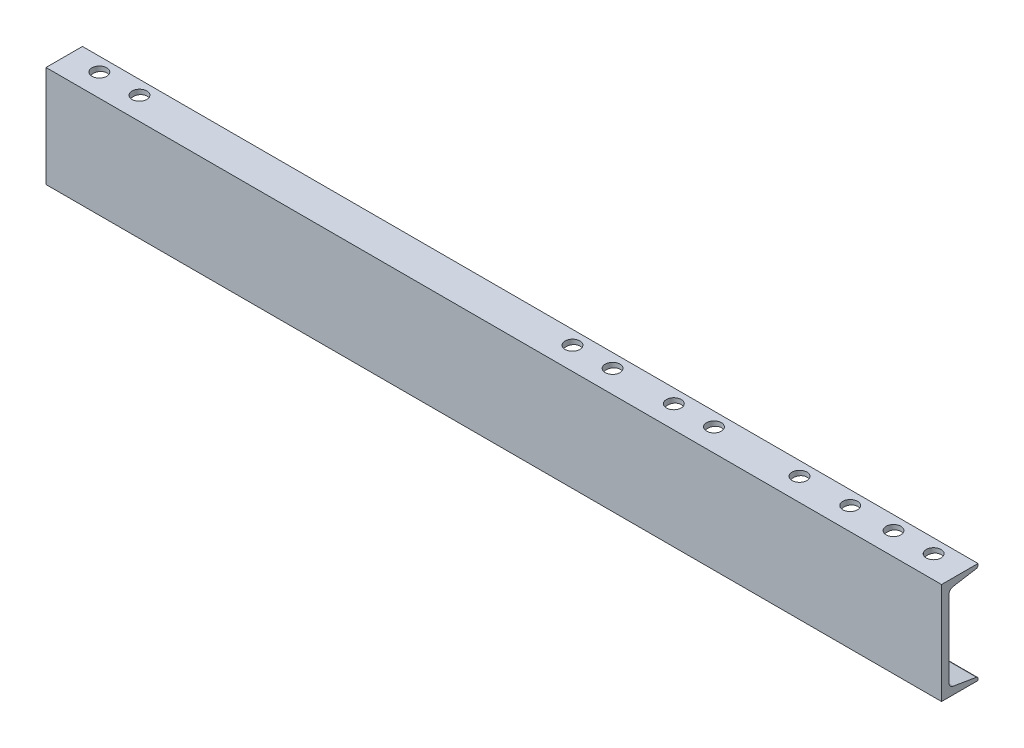
ISO-10303-21;
HEADER;
FILE_DESCRIPTION(('STEP AP214'),'2;1');
FILE_NAME('part.step','',(''),(''),'','','');
FILE_SCHEMA(('AUTOMOTIVE_DESIGN { 1 0 10303 214 1 1 1 1 }'));
ENDSEC;
DATA;
#1=APPLICATION_CONTEXT('core data for automotive mechanical design processes');
#2=APPLICATION_PROTOCOL_DEFINITION('international standard','automotive_design',2000,#1);
#3=PRODUCT_CONTEXT('',#1,'mechanical');
#4=PRODUCT('Part','Part','',(#3));
#5=PRODUCT_RELATED_PRODUCT_CATEGORY('part','',(#4));
#6=PRODUCT_DEFINITION_FORMATION('','',#4);
#7=PRODUCT_DEFINITION_CONTEXT('part definition',#1,'design');
#8=PRODUCT_DEFINITION('design','',#6,#7);
#9=PRODUCT_DEFINITION_SHAPE('','',#8);
#10=(LENGTH_UNIT() NAMED_UNIT(*) SI_UNIT(.MILLI.,.METRE.));
#11=(NAMED_UNIT(*) PLANE_ANGLE_UNIT() SI_UNIT($,.RADIAN.));
#12=(NAMED_UNIT(*) SI_UNIT($,.STERADIAN.) SOLID_ANGLE_UNIT());
#13=UNCERTAINTY_MEASURE_WITH_UNIT(LENGTH_MEASURE(1.E-05),#10,'distance_accuracy_value','');
#14=(GEOMETRIC_REPRESENTATION_CONTEXT(3) GLOBAL_UNCERTAINTY_ASSIGNED_CONTEXT((#13)) GLOBAL_UNIT_ASSIGNED_CONTEXT((#10,
#11,#12)) REPRESENTATION_CONTEXT('',''));
#15=CARTESIAN_POINT('',(0.,0.,0.));
#16=DIRECTION('',(0.,0.,1.));
#17=DIRECTION('',(1.,0.,0.));
#18=AXIS2_PLACEMENT_3D('',#15,#16,#17);
#19=CARTESIAN_POINT('',(673.1,-76.2,27.3939));
#20=DIRECTION('',(0.,1.,0.));
#21=DIRECTION('',(0.,0.,1.));
#22=AXIS2_PLACEMENT_3D('',#19,#20,#21);
#23=PLANE('',#22);
#24=CARTESIAN_POINT('',(501.65,-76.2,-6.73735));
#25=DIRECTION('',(0.,-1.,0.));
#26=DIRECTION('',(0.,0.,-1.));
#27=AXIS2_PLACEMENT_3D('',#24,#25,#26);
#28=CIRCLE('',#27,11.1125);
#29=CARTESIAN_POINT('',(501.65,-76.2,-17.84985));
#30=VERTEX_POINT('',#29);
#31=EDGE_CURVE('E250',#30,#30,#28,.T.);
#32=ORIENTED_EDGE('',*,*,#31,.F.);
#33=EDGE_LOOP('',(#32));
#34=FACE_BOUND('',#33,.T.);
#35=CARTESIAN_POINT('',(425.45,-76.2,-6.73735));
#36=DIRECTION('',(0.,-1.,0.));
#37=DIRECTION('',(0.,0.,-1.));
#38=AXIS2_PLACEMENT_3D('',#35,#36,#37);
#39=CIRCLE('',#38,11.1125);
#40=CARTESIAN_POINT('',(425.45,-76.2,-17.84985));
#41=VERTEX_POINT('',#40);
#42=EDGE_CURVE('E254',#41,#41,#39,.T.);
#43=ORIENTED_EDGE('',*,*,#42,.F.);
#44=EDGE_LOOP('',(#43));
#45=FACE_BOUND('',#44,.T.);
#46=CARTESIAN_POINT('',(-627.0625,-76.2,-6.73735));
#47=DIRECTION('',(0.,-1.,0.));
#48=DIRECTION('',(0.,0.,-1.));
#49=AXIS2_PLACEMENT_3D('',#46,#47,#48);
#50=CIRCLE('',#49,11.1125);
#51=CARTESIAN_POINT('',(-627.0625,-76.2,-17.84985));
#52=VERTEX_POINT('',#51);
#53=EDGE_CURVE('E258',#52,#52,#50,.T.);
#54=ORIENTED_EDGE('',*,*,#53,.F.);
#55=EDGE_LOOP('',(#54));
#56=FACE_BOUND('',#55,.T.);
#57=CARTESIAN_POINT('',(-566.7375,-76.2,-6.73735));
#58=DIRECTION('',(0.,-1.,0.));
#59=DIRECTION('',(0.,0.,-1.));
#60=AXIS2_PLACEMENT_3D('',#57,#58,#59);
#61=CIRCLE('',#60,11.1125);
#62=CARTESIAN_POINT('',(-566.7375,-76.2,-17.84985));
#63=VERTEX_POINT('',#62);
#64=EDGE_CURVE('E262',#63,#63,#61,.T.);
#65=ORIENTED_EDGE('',*,*,#64,.F.);
#66=EDGE_LOOP('',(#65));
#67=FACE_BOUND('',#66,.T.);
#68=CARTESIAN_POINT('',(84.1375,-76.2,-6.73735));
#69=DIRECTION('',(0.,-1.,0.));
#70=DIRECTION('',(0.,0.,-1.));
#71=AXIS2_PLACEMENT_3D('',#68,#69,#70);
#72=CIRCLE('',#71,11.1125);
#73=CARTESIAN_POINT('',(84.1375,-76.2,-17.84985));
#74=VERTEX_POINT('',#73);
#75=EDGE_CURVE('E266',#74,#74,#72,.T.);
#76=ORIENTED_EDGE('',*,*,#75,.F.);
#77=EDGE_LOOP('',(#76));
#78=FACE_BOUND('',#77,.T.);
#79=CARTESIAN_POINT('',(236.5375,-76.2,-6.73735));
#80=DIRECTION('',(0.,-1.,0.));
#81=DIRECTION('',(0.,0.,-1.));
#82=AXIS2_PLACEMENT_3D('',#79,#80,#81);
#83=CIRCLE('',#82,11.1125);
#84=CARTESIAN_POINT('',(236.5375,-76.2,-17.84985));
#85=VERTEX_POINT('',#84);
#86=EDGE_CURVE('E270',#85,#85,#83,.T.);
#87=ORIENTED_EDGE('',*,*,#86,.F.);
#88=EDGE_LOOP('',(#87));
#89=FACE_BOUND('',#88,.T.);
#90=CARTESIAN_POINT('',(296.8625,-76.2,-6.73735));
#91=DIRECTION('',(0.,-1.,0.));
#92=DIRECTION('',(0.,0.,-1.));
#93=AXIS2_PLACEMENT_3D('',#90,#91,#92);
#94=CIRCLE('',#93,11.1125);
#95=CARTESIAN_POINT('',(296.8625,-76.2,-17.84985));
#96=VERTEX_POINT('',#95);
#97=EDGE_CURVE('E274',#96,#96,#94,.T.);
#98=ORIENTED_EDGE('',*,*,#97,.F.);
#99=EDGE_LOOP('',(#98));
#100=FACE_BOUND('',#99,.T.);
#101=CARTESIAN_POINT('',(144.4625,-76.2,-6.73735));
#102=DIRECTION('',(0.,-1.,0.));
#103=DIRECTION('',(0.,0.,-1.));
#104=AXIS2_PLACEMENT_3D('',#101,#102,#103);
#105=CIRCLE('',#104,11.1125);
#106=CARTESIAN_POINT('',(144.4625,-76.2,-17.84985));
#107=VERTEX_POINT('',#106);
#108=EDGE_CURVE('E278',#107,#107,#105,.T.);
#109=ORIENTED_EDGE('',*,*,#108,.F.);
#110=EDGE_LOOP('',(#109));
#111=FACE_BOUND('',#110,.T.);
#112=CARTESIAN_POINT('',(566.7375,-76.2,-6.73735));
#113=DIRECTION('',(0.,-1.,0.));
#114=DIRECTION('',(0.,0.,-1.));
#115=AXIS2_PLACEMENT_3D('',#112,#113,#114);
#116=CIRCLE('',#115,11.1125);
#117=CARTESIAN_POINT('',(566.7375,-76.2,-17.84985));
#118=VERTEX_POINT('',#117);
#119=EDGE_CURVE('E282',#118,#118,#116,.T.);
#120=ORIENTED_EDGE('',*,*,#119,.F.);
#121=EDGE_LOOP('',(#120));
#122=FACE_BOUND('',#121,.T.);
#123=CARTESIAN_POINT('',(627.0625,-76.2,-6.73735));
#124=DIRECTION('',(0.,-1.,0.));
#125=DIRECTION('',(0.,0.,-1.));
#126=AXIS2_PLACEMENT_3D('',#123,#124,#125);
#127=CIRCLE('',#126,11.1125);
#128=CARTESIAN_POINT('',(627.0625,-76.2,-17.84985));
#129=VERTEX_POINT('',#128);
#130=EDGE_CURVE('E285',#129,#129,#127,.T.);
#131=ORIENTED_EDGE('',*,*,#130,.F.);
#132=EDGE_LOOP('',(#131));
#133=FACE_BOUND('',#132,.T.);
#134=DIRECTION('',(0.,0.,-1.));
#135=VECTOR('',#134,1.);
#136=CARTESIAN_POINT('',(-673.1,-76.2,27.3939));
#137=LINE('',#136,#135);
#138=CARTESIAN_POINT('',(-673.1,-76.2,27.3939));
#139=VERTEX_POINT('',#138);
#140=CARTESIAN_POINT('',(-673.1,-76.2,-27.3939));
#141=VERTEX_POINT('',#140);
#142=EDGE_CURVE('E137',#139,#141,#137,.T.);
#143=ORIENTED_EDGE('',*,*,#142,.T.);
#144=DIRECTION('',(-1.,0.,0.));
#145=VECTOR('',#144,1.);
#146=CARTESIAN_POINT('',(673.1,-76.2,-27.3939));
#147=LINE('',#146,#145);
#148=CARTESIAN_POINT('',(673.1,-76.2,-27.3939));
#149=VERTEX_POINT('',#148);
#150=EDGE_CURVE('E11',#149,#141,#147,.T.);
#151=ORIENTED_EDGE('',*,*,#150,.F.);
#152=DIRECTION('',(0.,0.,-1.));
#153=VECTOR('',#152,1.);
#154=CARTESIAN_POINT('',(673.1,-76.2,27.3939));
#155=LINE('',#154,#153);
#156=CARTESIAN_POINT('',(673.1,-76.2,27.3939));
#157=VERTEX_POINT('',#156);
#158=EDGE_CURVE('E160',#157,#149,#155,.T.);
#159=ORIENTED_EDGE('',*,*,#158,.F.);
#160=DIRECTION('',(-1.,0.,0.));
#161=VECTOR('',#160,1.);
#162=CARTESIAN_POINT('',(673.1,-76.2,27.3939));
#163=LINE('',#162,#161);
#164=EDGE_CURVE('E133',#157,#139,#163,.T.);
#165=ORIENTED_EDGE('',*,*,#164,.T.);
#166=EDGE_LOOP('',(#143,#151,#159,#165));
#167=FACE_BOUND('',#166,.T.);
#168=ADVANCED_FACE('F17',(#34,#45,#56,#67,#78,#89,#100,#111,#122,#133,#167),#23,.F.);
#169=CARTESIAN_POINT('',(673.1,-76.2,-27.3939));
#170=DIRECTION('',(0.,0.,1.));
#171=DIRECTION('',(1.,0.,0.));
#172=AXIS2_PLACEMENT_3D('',#169,#170,#171);
#173=PLANE('',#172);
#174=DIRECTION('',(0.,1.,0.));
#175=VECTOR('',#174,1.);
#176=CARTESIAN_POINT('',(-673.1,-76.2,-27.3939));
#177=LINE('',#176,#175);
#178=CARTESIAN_POINT('',(-673.1,-73.7107446530364,-27.3939));
#179=VERTEX_POINT('',#178);
#180=EDGE_CURVE('E140',#141,#179,#177,.T.);
#181=ORIENTED_EDGE('',*,*,#180,.T.);
#182=DIRECTION('',(-1.,0.,0.));
#183=VECTOR('',#182,1.);
#184=CARTESIAN_POINT('',(673.1,-73.7107446530364,-27.3939));
#185=LINE('',#184,#183);
#186=CARTESIAN_POINT('',(673.1,-73.7107446530364,-27.3939));
#187=VERTEX_POINT('',#186);
#188=EDGE_CURVE('E25',#187,#179,#185,.T.);
#189=ORIENTED_EDGE('',*,*,#188,.F.);
#190=DIRECTION('',(0.,1.,0.));
#191=VECTOR('',#190,1.);
#192=CARTESIAN_POINT('',(673.1,-76.2,-27.3939));
#193=LINE('',#192,#191);
#194=EDGE_CURVE('E88',#149,#187,#193,.T.);
#195=ORIENTED_EDGE('',*,*,#194,.F.);
#196=ORIENTED_EDGE('',*,*,#150,.T.);
#197=EDGE_LOOP('',(#181,#189,#195,#196));
#198=FACE_BOUND('',#197,.T.);
#199=ADVANCED_FACE('F241',(#198),#173,.F.);
#200=CARTESIAN_POINT('',(673.1,-73.7107446530364,-24.3459));
#201=DIRECTION('',(-1.,0.,0.));
#202=DIRECTION('',(0.,0.,1.));
#203=AXIS2_PLACEMENT_3D('',#200,#201,#202);
#204=CYLINDRICAL_SURFACE('',#203,3.048);
#205=CARTESIAN_POINT('',(-673.1,-73.7107446530364,-24.3459));
#206=DIRECTION('',(1.,0.,0.));
#207=DIRECTION('',(0.,0.,-1.));
#208=AXIS2_PLACEMENT_3D('',#205,#206,#207);
#209=CIRCLE('',#208,3.048);
#210=CARTESIAN_POINT('',(-673.1,-70.7042219011292,-24.8470236796088));
#211=VERTEX_POINT('',#210);
#212=EDGE_CURVE('E143',#179,#211,#209,.T.);
#213=ORIENTED_EDGE('',*,*,#212,.T.);
#214=DIRECTION('',(-1.,0.,0.));
#215=VECTOR('',#214,1.);
#216=CARTESIAN_POINT('',(673.1,-70.7042219011292,-24.8470236796088));
#217=LINE('',#216,#215);
#218=CARTESIAN_POINT('',(673.1,-70.7042219011292,-24.8470236796088));
#219=VERTEX_POINT('',#218);
#220=EDGE_CURVE('E179',#219,#211,#217,.T.);
#221=ORIENTED_EDGE('',*,*,#220,.F.);
#222=CARTESIAN_POINT('',(673.1,-73.7107446530364,-24.3459));
#223=DIRECTION('',(1.,0.,0.));
#224=DIRECTION('',(0.,0.,-1.));
#225=AXIS2_PLACEMENT_3D('',#222,#223,#224);
#226=CIRCLE('',#225,3.048);
#227=EDGE_CURVE('E187',#187,#219,#226,.T.);
#228=ORIENTED_EDGE('',*,*,#227,.F.);
#229=ORIENTED_EDGE('',*,*,#188,.T.);
#230=EDGE_LOOP('',(#213,#221,#228,#229));
#231=FACE_BOUND('',#230,.T.);
#232=ADVANCED_FACE('F185',(#231),#204,.T.);
#233=CARTESIAN_POINT('',(673.1,-64.908143628462,9.92690919902199));
#234=DIRECTION('',(0.,-0.986391978972162,0.164410656039631));
#235=DIRECTION('',(0.,-0.164410656039631,-0.986391978972162));
#236=AXIS2_PLACEMENT_3D('',#233,#234,#235);
#237=PLANE('',#236);
#238=CARTESIAN_POINT('',(501.65,-67.6857227711681,-6.73735));
#239=DIRECTION('',(0.,-0.986391978972162,0.164410656039631));
#240=DIRECTION('',(0.,-0.164410656039631,-0.986391978972162));
#241=AXIS2_PLACEMENT_3D('',#238,#239,#240);
#242=ELLIPSE('',#241,11.2658053156306,11.1125);
#243=CARTESIAN_POINT('',(501.65,-69.5379412139257,-17.8498499999999));
#244=VERTEX_POINT('',#243);
#245=EDGE_CURVE('E516',#244,#244,#242,.T.);
#246=ORIENTED_EDGE('',*,*,#245,.T.);
#247=EDGE_LOOP('',(#246));
#248=FACE_BOUND('',#247,.T.);
#249=CARTESIAN_POINT('',(425.45,-67.6857227711681,-6.73735));
#250=DIRECTION('',(0.,-0.986391978972162,0.164410656039631));
#251=DIRECTION('',(0.,-0.164410656039631,-0.986391978972162));
#252=AXIS2_PLACEMENT_3D('',#249,#250,#251);
#253=ELLIPSE('',#252,11.2658053156306,11.1125);
#254=CARTESIAN_POINT('',(425.45,-69.5379412139257,-17.84985));
#255=VERTEX_POINT('',#254);
#256=EDGE_CURVE('E532',#255,#255,#253,.T.);
#257=ORIENTED_EDGE('',*,*,#256,.T.);
#258=EDGE_LOOP('',(#257));
#259=FACE_BOUND('',#258,.T.);
#260=CARTESIAN_POINT('',(-627.0625,-67.6857227711681,-6.73735));
#261=DIRECTION('',(0.,-0.986391978972162,0.164410656039631));
#262=DIRECTION('',(0.,-0.164410656039631,-0.986391978972162));
#263=AXIS2_PLACEMENT_3D('',#260,#261,#262);
#264=ELLIPSE('',#263,11.2658053156306,11.1125);
#265=CARTESIAN_POINT('',(-627.0625,-69.5379412139257,-17.8498499999999));
#266=VERTEX_POINT('',#265);
#267=EDGE_CURVE('E542',#266,#266,#264,.T.);
#268=ORIENTED_EDGE('',*,*,#267,.T.);
#269=EDGE_LOOP('',(#268));
#270=FACE_BOUND('',#269,.T.);
#271=CARTESIAN_POINT('',(-566.7375,-67.6857227711681,-6.73735));
#272=DIRECTION('',(0.,-0.986391978972162,0.164410656039631));
#273=DIRECTION('',(0.,-0.164410656039631,-0.986391978972162));
#274=AXIS2_PLACEMENT_3D('',#271,#272,#273);
#275=ELLIPSE('',#274,11.2658053156306,11.1125);
#276=CARTESIAN_POINT('',(-566.7375,-69.5379412139257,-17.8498499999999));
#277=VERTEX_POINT('',#276);
#278=EDGE_CURVE('E552',#277,#277,#275,.T.);
#279=ORIENTED_EDGE('',*,*,#278,.T.);
#280=EDGE_LOOP('',(#279));
#281=FACE_BOUND('',#280,.T.);
#282=CARTESIAN_POINT('',(84.1375,-67.6857227711681,-6.73735));
#283=DIRECTION('',(0.,-0.986391978972162,0.164410656039631));
#284=DIRECTION('',(0.,-0.164410656039631,-0.986391978972162));
#285=AXIS2_PLACEMENT_3D('',#282,#283,#284);
#286=ELLIPSE('',#285,11.2658053156306,11.1125);
#287=CARTESIAN_POINT('',(84.1375,-69.5379412139257,-17.8498499999999));
#288=VERTEX_POINT('',#287);
#289=EDGE_CURVE('E562',#288,#288,#286,.T.);
#290=ORIENTED_EDGE('',*,*,#289,.T.);
#291=EDGE_LOOP('',(#290));
#292=FACE_BOUND('',#291,.T.);
#293=CARTESIAN_POINT('',(236.5375,-67.6857227711681,-6.73735));
#294=DIRECTION('',(0.,-0.986391978972162,0.164410656039631));
#295=DIRECTION('',(0.,-0.164410656039631,-0.986391978972162));
#296=AXIS2_PLACEMENT_3D('',#293,#294,#295);
#297=ELLIPSE('',#296,11.2658053156306,11.1125);
#298=CARTESIAN_POINT('',(236.5375,-69.5379412139257,-17.8498499999999));
#299=VERTEX_POINT('',#298);
#300=EDGE_CURVE('E572',#299,#299,#297,.T.);
#301=ORIENTED_EDGE('',*,*,#300,.T.);
#302=EDGE_LOOP('',(#301));
#303=FACE_BOUND('',#302,.T.);
#304=CARTESIAN_POINT('',(296.8625,-67.6857227711681,-6.73735));
#305=DIRECTION('',(0.,-0.986391978972162,0.164410656039631));
#306=DIRECTION('',(0.,-0.164410656039631,-0.986391978972162));
#307=AXIS2_PLACEMENT_3D('',#304,#305,#306);
#308=ELLIPSE('',#307,11.2658053156306,11.1125);
#309=CARTESIAN_POINT('',(296.8625,-69.5379412139257,-17.8498499999999));
#310=VERTEX_POINT('',#309);
#311=EDGE_CURVE('E582',#310,#310,#308,.T.);
#312=ORIENTED_EDGE('',*,*,#311,.T.);
#313=EDGE_LOOP('',(#312));
#314=FACE_BOUND('',#313,.T.);
#315=CARTESIAN_POINT('',(144.4625,-67.6857227711681,-6.73735));
#316=DIRECTION('',(0.,-0.986391978972162,0.164410656039631));
#317=DIRECTION('',(0.,-0.164410656039631,-0.986391978972162));
#318=AXIS2_PLACEMENT_3D('',#315,#316,#317);
#319=ELLIPSE('',#318,11.2658053156306,11.1125);
#320=CARTESIAN_POINT('',(144.4625,-69.5379412139257,-17.8498499999999));
#321=VERTEX_POINT('',#320);
#322=EDGE_CURVE('E592',#321,#321,#319,.T.);
#323=ORIENTED_EDGE('',*,*,#322,.T.);
#324=EDGE_LOOP('',(#323));
#325=FACE_BOUND('',#324,.T.);
#326=CARTESIAN_POINT('',(566.7375,-67.6857227711681,-6.73735));
#327=DIRECTION('',(0.,-0.986391978972162,0.164410656039631));
#328=DIRECTION('',(0.,-0.164410656039631,-0.986391978972162));
#329=AXIS2_PLACEMENT_3D('',#326,#327,#328);
#330=ELLIPSE('',#329,11.2658053156306,11.1125);
#331=CARTESIAN_POINT('',(566.7375,-69.5379412139257,-17.8498499999999));
#332=VERTEX_POINT('',#331);
#333=EDGE_CURVE('E288',#332,#332,#330,.T.);
#334=ORIENTED_EDGE('',*,*,#333,.T.);
#335=EDGE_LOOP('',(#334));
#336=FACE_BOUND('',#335,.T.);
#337=CARTESIAN_POINT('',(627.0625,-67.6857227711681,-6.73735));
#338=DIRECTION('',(0.,-0.986391978972162,0.164410656039631));
#339=DIRECTION('',(0.,-0.164410656039631,-0.986391978972162));
#340=AXIS2_PLACEMENT_3D('',#337,#338,#339);
#341=ELLIPSE('',#340,11.2658053156306,11.1125);
#342=CARTESIAN_POINT('',(627.0625,-69.5379412139257,-17.8498499999999));
#343=VERTEX_POINT('',#342);
#344=EDGE_CURVE('E141',#343,#343,#341,.T.);
#345=ORIENTED_EDGE('',*,*,#344,.T.);
#346=EDGE_LOOP('',(#345));
#347=FACE_BOUND('',#346,.T.);
#348=DIRECTION('',(0.,0.164410656039631,0.986391978972162));
#349=VECTOR('',#348,1.);
#350=CARTESIAN_POINT('',(-673.1,-64.908143628462,9.92690919902199));
#351=LINE('',#350,#349);
#352=CARTESIAN_POINT('',(-673.1,-64.908143628462,9.92690919902199));
#353=VERTEX_POINT('',#352);
#354=EDGE_CURVE('E145',#211,#353,#351,.T.);
#355=ORIENTED_EDGE('',*,*,#354,.T.);
#356=DIRECTION('',(-1.,0.,0.));
#357=VECTOR('',#356,1.);
#358=CARTESIAN_POINT('',(673.1,-64.908143628462,9.92690919902199));
#359=LINE('',#358,#357);
#360=CARTESIAN_POINT('',(673.1,-64.908143628462,9.92690919902199));
#361=VERTEX_POINT('',#360);
#362=EDGE_CURVE('E176',#361,#353,#359,.T.);
#363=ORIENTED_EDGE('',*,*,#362,.F.);
#364=DIRECTION('',(0.,0.164410656039631,0.986391978972162));
#365=VECTOR('',#364,1.);
#366=CARTESIAN_POINT('',(673.1,-64.908143628462,9.92690919902199));
#367=LINE('',#366,#365);
#368=EDGE_CURVE('E205',#219,#361,#367,.T.);
#369=ORIENTED_EDGE('',*,*,#368,.F.);
#370=ORIENTED_EDGE('',*,*,#220,.T.);
#371=EDGE_LOOP('',(#355,#363,#369,#370));
#372=FACE_BOUND('',#371,.T.);
#373=ADVANCED_FACE('F196',(#248,#259,#270,#281,#292,#303,#314,#325,#336,#347,#372),#237,.F.);
#374=CARTESIAN_POINT('',(673.1,-57.3918367486941,8.6741));
#375=DIRECTION('',(-1.,0.,0.));
#376=DIRECTION('',(0.,0.,1.));
#377=AXIS2_PLACEMENT_3D('',#374,#375,#376);
#378=CYLINDRICAL_SURFACE('',#377,7.62);
#379=CARTESIAN_POINT('',(-673.1,-57.3918367486941,8.6741));
#380=DIRECTION('',(-1.,0.,0.));
#381=DIRECTION('',(0.,0.,-1.));
#382=AXIS2_PLACEMENT_3D('',#379,#380,#381);
#383=CIRCLE('',#382,7.62);
#384=CARTESIAN_POINT('',(-673.1,-57.3918367486941,16.2941));
#385=VERTEX_POINT('',#384);
#386=EDGE_CURVE('E147',#353,#385,#383,.T.);
#387=ORIENTED_EDGE('',*,*,#386,.T.);
#388=DIRECTION('',(-1.,0.,0.));
#389=VECTOR('',#388,1.);
#390=CARTESIAN_POINT('',(673.1,-57.3918367486941,16.2941));
#391=LINE('',#390,#389);
#392=CARTESIAN_POINT('',(673.1,-57.3918367486941,16.2941));
#393=VERTEX_POINT('',#392);
#394=EDGE_CURVE('E173',#393,#385,#391,.T.);
#395=ORIENTED_EDGE('',*,*,#394,.F.);
#396=CARTESIAN_POINT('',(673.1,-57.3918367486941,8.6741));
#397=DIRECTION('',(-1.,0.,0.));
#398=DIRECTION('',(0.,0.,-1.));
#399=AXIS2_PLACEMENT_3D('',#396,#397,#398);
#400=CIRCLE('',#399,7.62);
#401=EDGE_CURVE('E202',#361,#393,#400,.T.);
#402=ORIENTED_EDGE('',*,*,#401,.F.);
#403=ORIENTED_EDGE('',*,*,#362,.T.);
#404=EDGE_LOOP('',(#387,#395,#402,#403));
#405=FACE_BOUND('',#404,.T.);
#406=ADVANCED_FACE('F200',(#405),#378,.F.);
#407=CARTESIAN_POINT('',(673.1,57.3918367486941,16.2941));
#408=DIRECTION('',(0.,0.,1.));
#409=DIRECTION('',(0.,-1.,0.));
#410=AXIS2_PLACEMENT_3D('',#407,#408,#409);
#411=PLANE('',#410);
#412=DIRECTION('',(0.,1.,0.));
#413=VECTOR('',#412,1.);
#414=CARTESIAN_POINT('',(-673.1,57.3918367486941,16.2941));
#415=LINE('',#414,#413);
#416=CARTESIAN_POINT('',(-673.1,57.3918367486941,16.2941));
#417=VERTEX_POINT('',#416);
#418=EDGE_CURVE('E149',#385,#417,#415,.T.);
#419=ORIENTED_EDGE('',*,*,#418,.T.);
#420=DIRECTION('',(-1.,0.,0.));
#421=VECTOR('',#420,1.);
#422=CARTESIAN_POINT('',(673.1,57.3918367486941,16.2941));
#423=LINE('',#422,#421);
#424=CARTESIAN_POINT('',(673.1,57.3918367486941,16.2941));
#425=VERTEX_POINT('',#424);
#426=EDGE_CURVE('E170',#425,#417,#423,.T.);
#427=ORIENTED_EDGE('',*,*,#426,.F.);
#428=DIRECTION('',(0.,1.,0.));
#429=VECTOR('',#428,1.);
#430=CARTESIAN_POINT('',(673.1,57.3918367486941,16.2941));
#431=LINE('',#430,#429);
#432=EDGE_CURVE('E204',#393,#425,#431,.T.);
#433=ORIENTED_EDGE('',*,*,#432,.F.);
#434=ORIENTED_EDGE('',*,*,#394,.T.);
#435=EDGE_LOOP('',(#419,#427,#433,#434));
#436=FACE_BOUND('',#435,.T.);
#437=ADVANCED_FACE('F615',(#436),#411,.F.);
#438=CARTESIAN_POINT('',(673.1,57.3918367486941,8.6741));
#439=DIRECTION('',(-1.,0.,0.));
#440=DIRECTION('',(0.,0.,1.));
#441=AXIS2_PLACEMENT_3D('',#438,#439,#440);
#442=CYLINDRICAL_SURFACE('',#441,7.62);
#443=CARTESIAN_POINT('',(-673.1,57.3918367486941,8.6741));
#444=DIRECTION('',(-1.,0.,0.));
#445=DIRECTION('',(0.,0.,1.));
#446=AXIS2_PLACEMENT_3D('',#443,#444,#445);
#447=CIRCLE('',#446,7.62);
#448=CARTESIAN_POINT('',(-673.1,64.908143628462,9.92690919902198));
#449=VERTEX_POINT('',#448);
#450=EDGE_CURVE('E151',#417,#449,#447,.T.);
#451=ORIENTED_EDGE('',*,*,#450,.T.);
#452=DIRECTION('',(-1.,0.,0.));
#453=VECTOR('',#452,1.);
#454=CARTESIAN_POINT('',(673.1,64.908143628462,9.92690919902198));
#455=LINE('',#454,#453);
#456=CARTESIAN_POINT('',(673.1,64.908143628462,9.92690919902198));
#457=VERTEX_POINT('',#456);
#458=EDGE_CURVE('E167',#457,#449,#455,.T.);
#459=ORIENTED_EDGE('',*,*,#458,.F.);
#460=CARTESIAN_POINT('',(673.1,57.3918367486941,8.6741));
#461=DIRECTION('',(-1.,0.,0.));
#462=DIRECTION('',(0.,0.,1.));
#463=AXIS2_PLACEMENT_3D('',#460,#461,#462);
#464=CIRCLE('',#463,7.62);
#465=EDGE_CURVE('E207',#425,#457,#464,.T.);
#466=ORIENTED_EDGE('',*,*,#465,.F.);
#467=ORIENTED_EDGE('',*,*,#426,.T.);
#468=EDGE_LOOP('',(#451,#459,#466,#467));
#469=FACE_BOUND('',#468,.T.);
#470=ADVANCED_FACE('F604',(#469),#442,.F.);
#471=CARTESIAN_POINT('',(673.1,64.908143628462,9.92690919902198));
#472=DIRECTION('',(0.,0.986391978972162,0.16441065603963));
#473=DIRECTION('',(0.,-0.16441065603963,0.986391978972162));
#474=AXIS2_PLACEMENT_3D('',#471,#472,#473);
#475=PLANE('',#474);
#476=CARTESIAN_POINT('',(501.65,67.6857227711681,-6.73735));
#477=DIRECTION('',(0.,0.986391978972162,0.16441065603963));
#478=DIRECTION('',(0.,-0.16441065603963,0.986391978972162));
#479=AXIS2_PLACEMENT_3D('',#476,#477,#478);
#480=ELLIPSE('',#479,11.2658053156306,11.1125);
#481=CARTESIAN_POINT('',(501.65,65.8335043284105,4.37514999999995));
#482=VERTEX_POINT('',#481);
#483=EDGE_CURVE('E518',#482,#482,#480,.T.);
#484=ORIENTED_EDGE('',*,*,#483,.T.);
#485=EDGE_LOOP('',(#484));
#486=FACE_BOUND('',#485,.T.);
#487=CARTESIAN_POINT('',(425.45,67.6857227711681,-6.73735));
#488=DIRECTION('',(0.,0.986391978972162,0.16441065603963));
#489=DIRECTION('',(0.,-0.16441065603963,0.986391978972162));
#490=AXIS2_PLACEMENT_3D('',#487,#488,#489);
#491=ELLIPSE('',#490,11.2658053156306,11.1125);
#492=CARTESIAN_POINT('',(425.45,65.8335043284105,4.37515000000001));
#493=VERTEX_POINT('',#492);
#494=EDGE_CURVE('E529',#493,#493,#491,.T.);
#495=ORIENTED_EDGE('',*,*,#494,.T.);
#496=EDGE_LOOP('',(#495));
#497=FACE_BOUND('',#496,.T.);
#498=CARTESIAN_POINT('',(-627.0625,67.6857227711681,-6.73735));
#499=DIRECTION('',(0.,0.986391978972162,0.16441065603963));
#500=DIRECTION('',(0.,-0.16441065603963,0.986391978972162));
#501=AXIS2_PLACEMENT_3D('',#498,#499,#500);
#502=ELLIPSE('',#501,11.2658053156306,11.1125);
#503=CARTESIAN_POINT('',(-627.0625,65.8335043284105,4.37514999999995));
#504=VERTEX_POINT('',#503);
#505=EDGE_CURVE('E539',#504,#504,#502,.T.);
#506=ORIENTED_EDGE('',*,*,#505,.T.);
#507=EDGE_LOOP('',(#506));
#508=FACE_BOUND('',#507,.T.);
#509=CARTESIAN_POINT('',(-566.7375,67.6857227711681,-6.73735));
#510=DIRECTION('',(0.,0.986391978972162,0.16441065603963));
#511=DIRECTION('',(0.,-0.16441065603963,0.986391978972162));
#512=AXIS2_PLACEMENT_3D('',#509,#510,#511);
#513=ELLIPSE('',#512,11.2658053156306,11.1125);
#514=CARTESIAN_POINT('',(-566.7375,65.8335043284105,4.37514999999995));
#515=VERTEX_POINT('',#514);
#516=EDGE_CURVE('E549',#515,#515,#513,.T.);
#517=ORIENTED_EDGE('',*,*,#516,.T.);
#518=EDGE_LOOP('',(#517));
#519=FACE_BOUND('',#518,.T.);
#520=CARTESIAN_POINT('',(84.1375,67.6857227711681,-6.73735));
#521=DIRECTION('',(0.,0.986391978972162,0.16441065603963));
#522=DIRECTION('',(0.,-0.16441065603963,0.986391978972162));
#523=AXIS2_PLACEMENT_3D('',#520,#521,#522);
#524=ELLIPSE('',#523,11.2658053156306,11.1125);
#525=CARTESIAN_POINT('',(84.1375,65.8335043284105,4.37514999999995));
#526=VERTEX_POINT('',#525);
#527=EDGE_CURVE('E559',#526,#526,#524,.T.);
#528=ORIENTED_EDGE('',*,*,#527,.T.);
#529=EDGE_LOOP('',(#528));
#530=FACE_BOUND('',#529,.T.);
#531=CARTESIAN_POINT('',(236.5375,67.6857227711681,-6.73735));
#532=DIRECTION('',(0.,0.986391978972162,0.16441065603963));
#533=DIRECTION('',(0.,-0.16441065603963,0.986391978972162));
#534=AXIS2_PLACEMENT_3D('',#531,#532,#533);
#535=ELLIPSE('',#534,11.2658053156306,11.1125);
#536=CARTESIAN_POINT('',(236.5375,65.8335043284105,4.37514999999995));
#537=VERTEX_POINT('',#536);
#538=EDGE_CURVE('E569',#537,#537,#535,.T.);
#539=ORIENTED_EDGE('',*,*,#538,.T.);
#540=EDGE_LOOP('',(#539));
#541=FACE_BOUND('',#540,.T.);
#542=CARTESIAN_POINT('',(296.8625,67.6857227711681,-6.73735));
#543=DIRECTION('',(0.,0.986391978972162,0.16441065603963));
#544=DIRECTION('',(0.,-0.16441065603963,0.986391978972162));
#545=AXIS2_PLACEMENT_3D('',#542,#543,#544);
#546=ELLIPSE('',#545,11.2658053156306,11.1125);
#547=CARTESIAN_POINT('',(296.8625,65.8335043284105,4.37514999999995));
#548=VERTEX_POINT('',#547);
#549=EDGE_CURVE('E579',#548,#548,#546,.T.);
#550=ORIENTED_EDGE('',*,*,#549,.T.);
#551=EDGE_LOOP('',(#550));
#552=FACE_BOUND('',#551,.T.);
#553=CARTESIAN_POINT('',(144.4625,67.6857227711681,-6.73735));
#554=DIRECTION('',(0.,0.986391978972162,0.16441065603963));
#555=DIRECTION('',(0.,-0.16441065603963,0.986391978972162));
#556=AXIS2_PLACEMENT_3D('',#553,#554,#555);
#557=ELLIPSE('',#556,11.2658053156306,11.1125);
#558=CARTESIAN_POINT('',(144.4625,65.8335043284105,4.37514999999995));
#559=VERTEX_POINT('',#558);
#560=EDGE_CURVE('E589',#559,#559,#557,.T.);
#561=ORIENTED_EDGE('',*,*,#560,.T.);
#562=EDGE_LOOP('',(#561));
#563=FACE_BOUND('',#562,.T.);
#564=CARTESIAN_POINT('',(566.7375,67.6857227711681,-6.73735));
#565=DIRECTION('',(0.,0.986391978972162,0.16441065603963));
#566=DIRECTION('',(0.,-0.16441065603963,0.986391978972162));
#567=AXIS2_PLACEMENT_3D('',#564,#565,#566);
#568=ELLIPSE('',#567,11.2658053156306,11.1125);
#569=CARTESIAN_POINT('',(566.7375,65.8335043284105,4.37514999999995));
#570=VERTEX_POINT('',#569);
#571=EDGE_CURVE('E294',#570,#570,#568,.T.);
#572=ORIENTED_EDGE('',*,*,#571,.T.);
#573=EDGE_LOOP('',(#572));
#574=FACE_BOUND('',#573,.T.);
#575=CARTESIAN_POINT('',(627.0625,67.6857227711681,-6.73735));
#576=DIRECTION('',(0.,0.986391978972162,0.16441065603963));
#577=DIRECTION('',(0.,-0.16441065603963,0.986391978972162));
#578=AXIS2_PLACEMENT_3D('',#575,#576,#577);
#579=ELLIPSE('',#578,11.2658053156306,11.1125);
#580=CARTESIAN_POINT('',(627.0625,65.8335043284105,4.37514999999995));
#581=VERTEX_POINT('',#580);
#582=EDGE_CURVE('E291',#581,#581,#579,.T.);
#583=ORIENTED_EDGE('',*,*,#582,.T.);
#584=EDGE_LOOP('',(#583));
#585=FACE_BOUND('',#584,.T.);
#586=DIRECTION('',(0.,0.16441065603963,-0.986391978972162));
#587=VECTOR('',#586,1.);
#588=CARTESIAN_POINT('',(-673.1,64.908143628462,9.92690919902198));
#589=LINE('',#588,#587);
#590=CARTESIAN_POINT('',(-673.1,70.7042219011292,-24.8470236796088));
#591=VERTEX_POINT('',#590);
#592=EDGE_CURVE('E153',#449,#591,#589,.T.);
#593=ORIENTED_EDGE('',*,*,#592,.T.);
#594=DIRECTION('',(-1.,0.,0.));
#595=VECTOR('',#594,1.);
#596=CARTESIAN_POINT('',(673.1,70.7042219011292,-24.8470236796088));
#597=LINE('',#596,#595);
#598=CARTESIAN_POINT('',(673.1,70.7042219011292,-24.8470236796088));
#599=VERTEX_POINT('',#598);
#600=EDGE_CURVE('E164',#599,#591,#597,.T.);
#601=ORIENTED_EDGE('',*,*,#600,.F.);
#602=DIRECTION('',(0.,0.16441065603963,-0.986391978972162));
#603=VECTOR('',#602,1.);
#604=CARTESIAN_POINT('',(673.1,64.908143628462,9.92690919902198));
#605=LINE('',#604,#603);
#606=EDGE_CURVE('E213',#457,#599,#605,.T.);
#607=ORIENTED_EDGE('',*,*,#606,.F.);
#608=ORIENTED_EDGE('',*,*,#458,.T.);
#609=EDGE_LOOP('',(#593,#601,#607,#608));
#610=FACE_BOUND('',#609,.T.);
#611=ADVANCED_FACE('F219',(#486,#497,#508,#519,#530,#541,#552,#563,#574,#585,#610),#475,.F.);
#612=CARTESIAN_POINT('',(673.1,73.7107446530364,-24.3459));
#613=DIRECTION('',(-1.,0.,0.));
#614=DIRECTION('',(0.,0.,1.));
#615=AXIS2_PLACEMENT_3D('',#612,#613,#614);
#616=CYLINDRICAL_SURFACE('',#615,3.048);
#617=CARTESIAN_POINT('',(-673.1,73.7107446530364,-24.3459));
#618=DIRECTION('',(1.,0.,0.));
#619=DIRECTION('',(0.,0.,1.));
#620=AXIS2_PLACEMENT_3D('',#617,#618,#619);
#621=CIRCLE('',#620,3.048);
#622=CARTESIAN_POINT('',(-673.1,73.7107446530364,-27.3939));
#623=VERTEX_POINT('',#622);
#624=EDGE_CURVE('E155',#591,#623,#621,.T.);
#625=ORIENTED_EDGE('',*,*,#624,.T.);
#626=DIRECTION('',(-1.,0.,0.));
#627=VECTOR('',#626,1.);
#628=CARTESIAN_POINT('',(673.1,73.7107446530364,-27.3939));
#629=LINE('',#628,#627);
#630=CARTESIAN_POINT('',(673.1,73.7107446530364,-27.3939));
#631=VERTEX_POINT('',#630);
#632=EDGE_CURVE('E128',#631,#623,#629,.T.);
#633=ORIENTED_EDGE('',*,*,#632,.F.);
#634=CARTESIAN_POINT('',(673.1,73.7107446530364,-24.3459));
#635=DIRECTION('',(1.,0.,0.));
#636=DIRECTION('',(0.,0.,1.));
#637=AXIS2_PLACEMENT_3D('',#634,#635,#636);
#638=CIRCLE('',#637,3.048);
#639=EDGE_CURVE('E119',#599,#631,#638,.T.);
#640=ORIENTED_EDGE('',*,*,#639,.F.);
#641=ORIENTED_EDGE('',*,*,#600,.T.);
#642=EDGE_LOOP('',(#625,#633,#640,#641));
#643=FACE_BOUND('',#642,.T.);
#644=ADVANCED_FACE('F223',(#643),#616,.T.);
#645=CARTESIAN_POINT('',(673.1,76.2,-27.3939));
#646=DIRECTION('',(0.,0.,1.));
#647=DIRECTION('',(0.,-1.,0.));
#648=AXIS2_PLACEMENT_3D('',#645,#646,#647);
#649=PLANE('',#648);
#650=DIRECTION('',(0.,1.,0.));
#651=VECTOR('',#650,1.);
#652=CARTESIAN_POINT('',(-673.1,76.2,-27.3939));
#653=LINE('',#652,#651);
#654=CARTESIAN_POINT('',(-673.1,76.2,-27.3939));
#655=VERTEX_POINT('',#654);
#656=EDGE_CURVE('E127',#623,#655,#653,.T.);
#657=ORIENTED_EDGE('',*,*,#656,.T.);
#658=DIRECTION('',(-1.,0.,0.));
#659=VECTOR('',#658,1.);
#660=CARTESIAN_POINT('',(673.1,76.2,-27.3939));
#661=LINE('',#660,#659);
#662=CARTESIAN_POINT('',(673.1,76.2,-27.3939));
#663=VERTEX_POINT('',#662);
#664=EDGE_CURVE('E124',#663,#655,#661,.T.);
#665=ORIENTED_EDGE('',*,*,#664,.F.);
#666=DIRECTION('',(0.,1.,0.));
#667=VECTOR('',#666,1.);
#668=CARTESIAN_POINT('',(673.1,76.2,-27.3939));
#669=LINE('',#668,#667);
#670=EDGE_CURVE('E113',#631,#663,#669,.T.);
#671=ORIENTED_EDGE('',*,*,#670,.F.);
#672=ORIENTED_EDGE('',*,*,#632,.T.);
#673=EDGE_LOOP('',(#657,#665,#671,#672));
#674=FACE_BOUND('',#673,.T.);
#675=ADVANCED_FACE('F125',(#674),#649,.F.);
#676=CARTESIAN_POINT('',(673.1,76.2,27.3939));
#677=DIRECTION('',(0.,-1.,0.));
#678=DIRECTION('',(0.,0.,-1.));
#679=AXIS2_PLACEMENT_3D('',#676,#677,#678);
#680=PLANE('',#679);
#681=CARTESIAN_POINT('',(501.65,76.2,-6.73735));
#682=DIRECTION('',(0.,-1.,0.));
#683=DIRECTION('',(0.,0.,-1.));
#684=AXIS2_PLACEMENT_3D('',#681,#682,#683);
#685=CIRCLE('',#684,11.1125);
#686=CARTESIAN_POINT('',(501.65,76.2,-17.84985));
#687=VERTEX_POINT('',#686);
#688=EDGE_CURVE('E523',#687,#687,#685,.F.);
#689=ORIENTED_EDGE('',*,*,#688,.F.);
#690=EDGE_LOOP('',(#689));
#691=FACE_BOUND('',#690,.T.);
#692=CARTESIAN_POINT('',(425.45,76.2,-6.73735));
#693=DIRECTION('',(0.,-1.,0.));
#694=DIRECTION('',(0.,0.,-1.));
#695=AXIS2_PLACEMENT_3D('',#692,#693,#694);
#696=CIRCLE('',#695,11.1125);
#697=CARTESIAN_POINT('',(425.45,76.2,-17.84985));
#698=VERTEX_POINT('',#697);
#699=EDGE_CURVE('E520',#698,#698,#696,.F.);
#700=ORIENTED_EDGE('',*,*,#699,.F.);
#701=EDGE_LOOP('',(#700));
#702=FACE_BOUND('',#701,.T.);
#703=CARTESIAN_POINT('',(-627.0625,76.2,-6.73735));
#704=DIRECTION('',(0.,-1.,0.));
#705=DIRECTION('',(0.,0.,-1.));
#706=AXIS2_PLACEMENT_3D('',#703,#704,#705);
#707=CIRCLE('',#706,11.1125);
#708=CARTESIAN_POINT('',(-627.0625,76.2,-17.84985));
#709=VERTEX_POINT('',#708);
#710=EDGE_CURVE('E536',#709,#709,#707,.F.);
#711=ORIENTED_EDGE('',*,*,#710,.F.);
#712=EDGE_LOOP('',(#711));
#713=FACE_BOUND('',#712,.T.);
#714=CARTESIAN_POINT('',(-566.7375,76.2,-6.73735));
#715=DIRECTION('',(0.,-1.,0.));
#716=DIRECTION('',(0.,0.,-1.));
#717=AXIS2_PLACEMENT_3D('',#714,#715,#716);
#718=CIRCLE('',#717,11.1125);
#719=CARTESIAN_POINT('',(-566.7375,76.2,-17.84985));
#720=VERTEX_POINT('',#719);
#721=EDGE_CURVE('E546',#720,#720,#718,.F.);
#722=ORIENTED_EDGE('',*,*,#721,.F.);
#723=EDGE_LOOP('',(#722));
#724=FACE_BOUND('',#723,.T.);
#725=CARTESIAN_POINT('',(84.1375,76.2,-6.73735));
#726=DIRECTION('',(0.,-1.,0.));
#727=DIRECTION('',(0.,0.,-1.));
#728=AXIS2_PLACEMENT_3D('',#725,#726,#727);
#729=CIRCLE('',#728,11.1125);
#730=CARTESIAN_POINT('',(84.1375,76.2,-17.84985));
#731=VERTEX_POINT('',#730);
#732=EDGE_CURVE('E556',#731,#731,#729,.F.);
#733=ORIENTED_EDGE('',*,*,#732,.F.);
#734=EDGE_LOOP('',(#733));
#735=FACE_BOUND('',#734,.T.);
#736=CARTESIAN_POINT('',(236.5375,76.2,-6.73735));
#737=DIRECTION('',(0.,-1.,0.));
#738=DIRECTION('',(0.,0.,-1.));
#739=AXIS2_PLACEMENT_3D('',#736,#737,#738);
#740=CIRCLE('',#739,11.1125);
#741=CARTESIAN_POINT('',(236.5375,76.2,-17.84985));
#742=VERTEX_POINT('',#741);
#743=EDGE_CURVE('E566',#742,#742,#740,.F.);
#744=ORIENTED_EDGE('',*,*,#743,.F.);
#745=EDGE_LOOP('',(#744));
#746=FACE_BOUND('',#745,.T.);
#747=CARTESIAN_POINT('',(296.8625,76.2,-6.73735));
#748=DIRECTION('',(0.,-1.,0.));
#749=DIRECTION('',(0.,0.,-1.));
#750=AXIS2_PLACEMENT_3D('',#747,#748,#749);
#751=CIRCLE('',#750,11.1125);
#752=CARTESIAN_POINT('',(296.8625,76.2,-17.84985));
#753=VERTEX_POINT('',#752);
#754=EDGE_CURVE('E576',#753,#753,#751,.F.);
#755=ORIENTED_EDGE('',*,*,#754,.F.);
#756=EDGE_LOOP('',(#755));
#757=FACE_BOUND('',#756,.T.);
#758=CARTESIAN_POINT('',(144.4625,76.2,-6.73735));
#759=DIRECTION('',(0.,-1.,0.));
#760=DIRECTION('',(0.,0.,-1.));
#761=AXIS2_PLACEMENT_3D('',#758,#759,#760);
#762=CIRCLE('',#761,11.1125);
#763=CARTESIAN_POINT('',(144.4625,76.2,-17.84985));
#764=VERTEX_POINT('',#763);
#765=EDGE_CURVE('E586',#764,#764,#762,.F.);
#766=ORIENTED_EDGE('',*,*,#765,.F.);
#767=EDGE_LOOP('',(#766));
#768=FACE_BOUND('',#767,.T.);
#769=CARTESIAN_POINT('',(566.7375,76.2,-6.73735));
#770=DIRECTION('',(0.,-1.,0.));
#771=DIRECTION('',(0.,0.,-1.));
#772=AXIS2_PLACEMENT_3D('',#769,#770,#771);
#773=CIRCLE('',#772,11.1125);
#774=CARTESIAN_POINT('',(566.7375,76.2,-17.84985));
#775=VERTEX_POINT('',#774);
#776=EDGE_CURVE('E596',#775,#775,#773,.F.);
#777=ORIENTED_EDGE('',*,*,#776,.F.);
#778=EDGE_LOOP('',(#777));
#779=FACE_BOUND('',#778,.T.);
#780=CARTESIAN_POINT('',(627.0625,76.2,-6.73735));
#781=DIRECTION('',(0.,-1.,0.));
#782=DIRECTION('',(0.,0.,-1.));
#783=AXIS2_PLACEMENT_3D('',#780,#781,#782);
#784=CIRCLE('',#783,11.1125);
#785=CARTESIAN_POINT('',(627.0625,76.2,-17.84985));
#786=VERTEX_POINT('',#785);
#787=EDGE_CURVE('E287',#786,#786,#784,.F.);
#788=ORIENTED_EDGE('',*,*,#787,.F.);
#789=EDGE_LOOP('',(#788));
#790=FACE_BOUND('',#789,.T.);
#791=DIRECTION('',(0.,0.,1.));
#792=VECTOR('',#791,1.);
#793=CARTESIAN_POINT('',(-673.1,76.2,27.3939));
#794=LINE('',#793,#792);
#795=CARTESIAN_POINT('',(-673.1,76.2,27.3939));
#796=VERTEX_POINT('',#795);
#797=EDGE_CURVE('E74',#655,#796,#794,.T.);
#798=ORIENTED_EDGE('',*,*,#797,.T.);
#799=DIRECTION('',(-1.,0.,0.));
#800=VECTOR('',#799,1.);
#801=CARTESIAN_POINT('',(673.1,76.2,27.3939));
#802=LINE('',#801,#800);
#803=CARTESIAN_POINT('',(673.1,76.2,27.3939));
#804=VERTEX_POINT('',#803);
#805=EDGE_CURVE('E129',#804,#796,#802,.T.);
#806=ORIENTED_EDGE('',*,*,#805,.F.);
#807=DIRECTION('',(0.,0.,1.));
#808=VECTOR('',#807,1.);
#809=CARTESIAN_POINT('',(673.1,76.2,27.3939));
#810=LINE('',#809,#808);
#811=EDGE_CURVE('E117',#663,#804,#810,.T.);
#812=ORIENTED_EDGE('',*,*,#811,.F.);
#813=ORIENTED_EDGE('',*,*,#664,.T.);
#814=EDGE_LOOP('',(#798,#806,#812,#813));
#815=FACE_BOUND('',#814,.T.);
#816=ADVANCED_FACE('F131',(#691,#702,#713,#724,#735,#746,#757,#768,#779,#790,#815),#680,.F.);
#817=CARTESIAN_POINT('',(673.1,-76.2,27.3939));
#818=DIRECTION('',(0.,0.,-1.));
#819=DIRECTION('',(-1.,0.,0.));
#820=AXIS2_PLACEMENT_3D('',#817,#818,#819);
#821=PLANE('',#820);
#822=DIRECTION('',(0.,-1.,0.));
#823=VECTOR('',#822,1.);
#824=CARTESIAN_POINT('',(-673.1,-76.2,27.3939));
#825=LINE('',#824,#823);
#826=EDGE_CURVE('E80',#796,#139,#825,.T.);
#827=ORIENTED_EDGE('',*,*,#826,.T.);
#828=ORIENTED_EDGE('',*,*,#164,.F.);
#829=DIRECTION('',(0.,-1.,0.));
#830=VECTOR('',#829,1.);
#831=CARTESIAN_POINT('',(673.1,-76.2,27.3939));
#832=LINE('',#831,#830);
#833=EDGE_CURVE('E33',#804,#157,#832,.T.);
#834=ORIENTED_EDGE('',*,*,#833,.F.);
#835=ORIENTED_EDGE('',*,*,#805,.T.);
#836=EDGE_LOOP('',(#827,#828,#834,#835));
#837=FACE_BOUND('',#836,.T.);
#838=ADVANCED_FACE('F227',(#837),#821,.F.);
#839=CARTESIAN_POINT('',(673.1,-73.7107446530364,-24.3459));
#840=DIRECTION('',(1.,0.,0.));
#841=DIRECTION('',(0.,0.,-1.));
#842=AXIS2_PLACEMENT_3D('',#839,#840,#841);
#843=PLANE('',#842);
#844=ORIENTED_EDGE('',*,*,#158,.T.);
#845=ORIENTED_EDGE('',*,*,#194,.T.);
#846=ORIENTED_EDGE('',*,*,#227,.T.);
#847=ORIENTED_EDGE('',*,*,#368,.T.);
#848=ORIENTED_EDGE('',*,*,#401,.T.);
#849=ORIENTED_EDGE('',*,*,#432,.T.);
#850=ORIENTED_EDGE('',*,*,#465,.T.);
#851=ORIENTED_EDGE('',*,*,#606,.T.);
#852=ORIENTED_EDGE('',*,*,#639,.T.);
#853=ORIENTED_EDGE('',*,*,#670,.T.);
#854=ORIENTED_EDGE('',*,*,#811,.T.);
#855=ORIENTED_EDGE('',*,*,#833,.T.);
#856=EDGE_LOOP('',(#844,#845,#846,#847,#848,#849,#850,#851,#852,#853,#854,#855));
#857=FACE_BOUND('',#856,.T.);
#858=ADVANCED_FACE('F115',(#857),#843,.T.);
#859=CARTESIAN_POINT('',(-673.1,-73.7107446530364,-24.3459));
#860=DIRECTION('',(1.,0.,0.));
#861=DIRECTION('',(0.,0.,-1.));
#862=AXIS2_PLACEMENT_3D('',#859,#860,#861);
#863=PLANE('',#862);
#864=ORIENTED_EDGE('',*,*,#142,.F.);
#865=ORIENTED_EDGE('',*,*,#826,.F.);
#866=ORIENTED_EDGE('',*,*,#797,.F.);
#867=ORIENTED_EDGE('',*,*,#656,.F.);
#868=ORIENTED_EDGE('',*,*,#624,.F.);
#869=ORIENTED_EDGE('',*,*,#592,.F.);
#870=ORIENTED_EDGE('',*,*,#450,.F.);
#871=ORIENTED_EDGE('',*,*,#418,.F.);
#872=ORIENTED_EDGE('',*,*,#386,.F.);
#873=ORIENTED_EDGE('',*,*,#354,.F.);
#874=ORIENTED_EDGE('',*,*,#212,.F.);
#875=ORIENTED_EDGE('',*,*,#180,.F.);
#876=EDGE_LOOP('',(#864,#865,#866,#867,#868,#869,#870,#871,#872,#873,#874,#875));
#877=FACE_BOUND('',#876,.T.);
#878=ADVANCED_FACE('F191',(#877),#863,.F.);
#879=CARTESIAN_POINT('',(627.0625,107.630896423742,-6.73735));
#880=DIRECTION('',(0.,-1.,0.));
#881=DIRECTION('',(0.,0.,-1.));
#882=AXIS2_PLACEMENT_3D('',#879,#880,#881);
#883=CYLINDRICAL_SURFACE('',#882,11.1125);
#884=ORIENTED_EDGE('',*,*,#787,.T.);
#885=EDGE_LOOP('',(#884));
#886=FACE_BOUND('',#885,.T.);
#887=ORIENTED_EDGE('',*,*,#582,.F.);
#888=EDGE_LOOP('',(#887));
#889=FACE_BOUND('',#888,.T.);
#890=ADVANCED_FACE('F309',(#886,#889),#883,.F.);
#891=ORIENTED_EDGE('',*,*,#130,.T.);
#892=EDGE_LOOP('',(#891));
#893=FACE_BOUND('',#892,.T.);
#894=ORIENTED_EDGE('',*,*,#344,.F.);
#895=EDGE_LOOP('',(#894));
#896=FACE_BOUND('',#895,.T.);
#897=ADVANCED_FACE('F306',(#893,#896),#883,.F.);
#898=CARTESIAN_POINT('',(566.7375,107.630896423742,-6.73735));
#899=DIRECTION('',(0.,-1.,0.));
#900=DIRECTION('',(0.,0.,-1.));
#901=AXIS2_PLACEMENT_3D('',#898,#899,#900);
#902=CYLINDRICAL_SURFACE('',#901,11.1125);
#903=ORIENTED_EDGE('',*,*,#776,.T.);
#904=EDGE_LOOP('',(#903));
#905=FACE_BOUND('',#904,.T.);
#906=ORIENTED_EDGE('',*,*,#571,.F.);
#907=EDGE_LOOP('',(#906));
#908=FACE_BOUND('',#907,.T.);
#909=ADVANCED_FACE('F308',(#905,#908),#902,.F.);
#910=ORIENTED_EDGE('',*,*,#119,.T.);
#911=EDGE_LOOP('',(#910));
#912=FACE_BOUND('',#911,.T.);
#913=ORIENTED_EDGE('',*,*,#333,.F.);
#914=EDGE_LOOP('',(#913));
#915=FACE_BOUND('',#914,.T.);
#916=ADVANCED_FACE('F316',(#912,#915),#902,.F.);
#917=CARTESIAN_POINT('',(144.4625,107.630896423742,-6.73735));
#918=DIRECTION('',(0.,-1.,0.));
#919=DIRECTION('',(0.,0.,-1.));
#920=AXIS2_PLACEMENT_3D('',#917,#918,#919);
#921=CYLINDRICAL_SURFACE('',#920,11.1125);
#922=ORIENTED_EDGE('',*,*,#765,.T.);
#923=EDGE_LOOP('',(#922));
#924=FACE_BOUND('',#923,.T.);
#925=ORIENTED_EDGE('',*,*,#560,.F.);
#926=EDGE_LOOP('',(#925));
#927=FACE_BOUND('',#926,.T.);
#928=ADVANCED_FACE('F356',(#924,#927),#921,.F.);
#929=ORIENTED_EDGE('',*,*,#108,.T.);
#930=EDGE_LOOP('',(#929));
#931=FACE_BOUND('',#930,.T.);
#932=ORIENTED_EDGE('',*,*,#322,.F.);
#933=EDGE_LOOP('',(#932));
#934=FACE_BOUND('',#933,.T.);
#935=ADVANCED_FACE('F366',(#931,#934),#921,.F.);
#936=CARTESIAN_POINT('',(296.8625,107.630896423742,-6.73735));
#937=DIRECTION('',(0.,-1.,0.));
#938=DIRECTION('',(0.,0.,-1.));
#939=AXIS2_PLACEMENT_3D('',#936,#937,#938);
#940=CYLINDRICAL_SURFACE('',#939,11.1125);
#941=ORIENTED_EDGE('',*,*,#754,.T.);
#942=EDGE_LOOP('',(#941));
#943=FACE_BOUND('',#942,.T.);
#944=ORIENTED_EDGE('',*,*,#549,.F.);
#945=EDGE_LOOP('',(#944));
#946=FACE_BOUND('',#945,.T.);
#947=ADVANCED_FACE('F376',(#943,#946),#940,.F.);
#948=ORIENTED_EDGE('',*,*,#97,.T.);
#949=EDGE_LOOP('',(#948));
#950=FACE_BOUND('',#949,.T.);
#951=ORIENTED_EDGE('',*,*,#311,.F.);
#952=EDGE_LOOP('',(#951));
#953=FACE_BOUND('',#952,.T.);
#954=ADVANCED_FACE('F386',(#950,#953),#940,.F.);
#955=CARTESIAN_POINT('',(236.5375,107.630896423742,-6.73735));
#956=DIRECTION('',(0.,-1.,0.));
#957=DIRECTION('',(0.,0.,-1.));
#958=AXIS2_PLACEMENT_3D('',#955,#956,#957);
#959=CYLINDRICAL_SURFACE('',#958,11.1125);
#960=ORIENTED_EDGE('',*,*,#743,.T.);
#961=EDGE_LOOP('',(#960));
#962=FACE_BOUND('',#961,.T.);
#963=ORIENTED_EDGE('',*,*,#538,.F.);
#964=EDGE_LOOP('',(#963));
#965=FACE_BOUND('',#964,.T.);
#966=ADVANCED_FACE('F396',(#962,#965),#959,.F.);
#967=ORIENTED_EDGE('',*,*,#86,.T.);
#968=EDGE_LOOP('',(#967));
#969=FACE_BOUND('',#968,.T.);
#970=ORIENTED_EDGE('',*,*,#300,.F.);
#971=EDGE_LOOP('',(#970));
#972=FACE_BOUND('',#971,.T.);
#973=ADVANCED_FACE('F405',(#969,#972),#959,.F.);
#974=CARTESIAN_POINT('',(84.1375,107.630896423742,-6.73735));
#975=DIRECTION('',(0.,-1.,0.));
#976=DIRECTION('',(0.,0.,-1.));
#977=AXIS2_PLACEMENT_3D('',#974,#975,#976);
#978=CYLINDRICAL_SURFACE('',#977,11.1125);
#979=ORIENTED_EDGE('',*,*,#732,.T.);
#980=EDGE_LOOP('',(#979));
#981=FACE_BOUND('',#980,.T.);
#982=ORIENTED_EDGE('',*,*,#527,.F.);
#983=EDGE_LOOP('',(#982));
#984=FACE_BOUND('',#983,.T.);
#985=ADVANCED_FACE('F415',(#981,#984),#978,.F.);
#986=ORIENTED_EDGE('',*,*,#75,.T.);
#987=EDGE_LOOP('',(#986));
#988=FACE_BOUND('',#987,.T.);
#989=ORIENTED_EDGE('',*,*,#289,.F.);
#990=EDGE_LOOP('',(#989));
#991=FACE_BOUND('',#990,.T.);
#992=ADVANCED_FACE('F424',(#988,#991),#978,.F.);
#993=CARTESIAN_POINT('',(-566.7375,107.630896423742,-6.73735));
#994=DIRECTION('',(0.,-1.,0.));
#995=DIRECTION('',(0.,0.,-1.));
#996=AXIS2_PLACEMENT_3D('',#993,#994,#995);
#997=CYLINDRICAL_SURFACE('',#996,11.1125);
#998=ORIENTED_EDGE('',*,*,#721,.T.);
#999=EDGE_LOOP('',(#998));
#1000=FACE_BOUND('',#999,.T.);
#1001=ORIENTED_EDGE('',*,*,#516,.F.);
#1002=EDGE_LOOP('',(#1001));
#1003=FACE_BOUND('',#1002,.T.);
#1004=ADVANCED_FACE('F434',(#1000,#1003),#997,.F.);
#1005=ORIENTED_EDGE('',*,*,#64,.T.);
#1006=EDGE_LOOP('',(#1005));
#1007=FACE_BOUND('',#1006,.T.);
#1008=ORIENTED_EDGE('',*,*,#278,.F.);
#1009=EDGE_LOOP('',(#1008));
#1010=FACE_BOUND('',#1009,.T.);
#1011=ADVANCED_FACE('F443',(#1007,#1010),#997,.F.);
#1012=CARTESIAN_POINT('',(-627.0625,107.630896423742,-6.73735));
#1013=DIRECTION('',(0.,-1.,0.));
#1014=DIRECTION('',(0.,0.,-1.));
#1015=AXIS2_PLACEMENT_3D('',#1012,#1013,#1014);
#1016=CYLINDRICAL_SURFACE('',#1015,11.1125);
#1017=ORIENTED_EDGE('',*,*,#710,.T.);
#1018=EDGE_LOOP('',(#1017));
#1019=FACE_BOUND('',#1018,.T.);
#1020=ORIENTED_EDGE('',*,*,#505,.F.);
#1021=EDGE_LOOP('',(#1020));
#1022=FACE_BOUND('',#1021,.T.);
#1023=ADVANCED_FACE('F453',(#1019,#1022),#1016,.F.);
#1024=ORIENTED_EDGE('',*,*,#53,.T.);
#1025=EDGE_LOOP('',(#1024));
#1026=FACE_BOUND('',#1025,.T.);
#1027=ORIENTED_EDGE('',*,*,#267,.F.);
#1028=EDGE_LOOP('',(#1027));
#1029=FACE_BOUND('',#1028,.T.);
#1030=ADVANCED_FACE('F462',(#1026,#1029),#1016,.F.);
#1031=CARTESIAN_POINT('',(425.45,107.630896423742,-6.73735));
#1032=DIRECTION('',(0.,-1.,0.));
#1033=DIRECTION('',(0.,0.,-1.));
#1034=AXIS2_PLACEMENT_3D('',#1031,#1032,#1033);
#1035=CYLINDRICAL_SURFACE('',#1034,11.1125);
#1036=ORIENTED_EDGE('',*,*,#699,.T.);
#1037=EDGE_LOOP('',(#1036));
#1038=FACE_BOUND('',#1037,.T.);
#1039=ORIENTED_EDGE('',*,*,#494,.F.);
#1040=EDGE_LOOP('',(#1039));
#1041=FACE_BOUND('',#1040,.T.);
#1042=ADVANCED_FACE('F472',(#1038,#1041),#1035,.F.);
#1043=ORIENTED_EDGE('',*,*,#42,.T.);
#1044=EDGE_LOOP('',(#1043));
#1045=FACE_BOUND('',#1044,.T.);
#1046=ORIENTED_EDGE('',*,*,#256,.F.);
#1047=EDGE_LOOP('',(#1046));
#1048=FACE_BOUND('',#1047,.T.);
#1049=ADVANCED_FACE('F481',(#1045,#1048),#1035,.F.);
#1050=CARTESIAN_POINT('',(501.65,107.630896423742,-6.73735));
#1051=DIRECTION('',(0.,-1.,0.));
#1052=DIRECTION('',(0.,0.,-1.));
#1053=AXIS2_PLACEMENT_3D('',#1050,#1051,#1052);
#1054=CYLINDRICAL_SURFACE('',#1053,11.1125);
#1055=ORIENTED_EDGE('',*,*,#688,.T.);
#1056=EDGE_LOOP('',(#1055));
#1057=FACE_BOUND('',#1056,.T.);
#1058=ORIENTED_EDGE('',*,*,#483,.F.);
#1059=EDGE_LOOP('',(#1058));
#1060=FACE_BOUND('',#1059,.T.);
#1061=ADVANCED_FACE('F490',(#1057,#1060),#1054,.F.);
#1062=ORIENTED_EDGE('',*,*,#31,.T.);
#1063=EDGE_LOOP('',(#1062));
#1064=FACE_BOUND('',#1063,.T.);
#1065=ORIENTED_EDGE('',*,*,#245,.F.);
#1066=EDGE_LOOP('',(#1065));
#1067=FACE_BOUND('',#1066,.T.);
#1068=ADVANCED_FACE('F499',(#1064,#1067),#1054,.F.);
#1069=CLOSED_SHELL('',(#168,#199,#232,#373,#406,#437,#470,#611,#644,#675,#816,#838,#858,#878,
#890,#897,#909,#916,#928,#935,#947,#954,#966,#973,#985,#992,#1004,#1011,#1023,#1030,#1042,#1049,
#1061,#1068));
#1070=MANIFOLD_SOLID_BREP('B1',#1069);
#1071=ADVANCED_BREP_SHAPE_REPRESENTATION('',(#18,#1070),#14);
#1072=SHAPE_DEFINITION_REPRESENTATION(#9,#1071);
ENDSEC;
END-ISO-10303-21;
